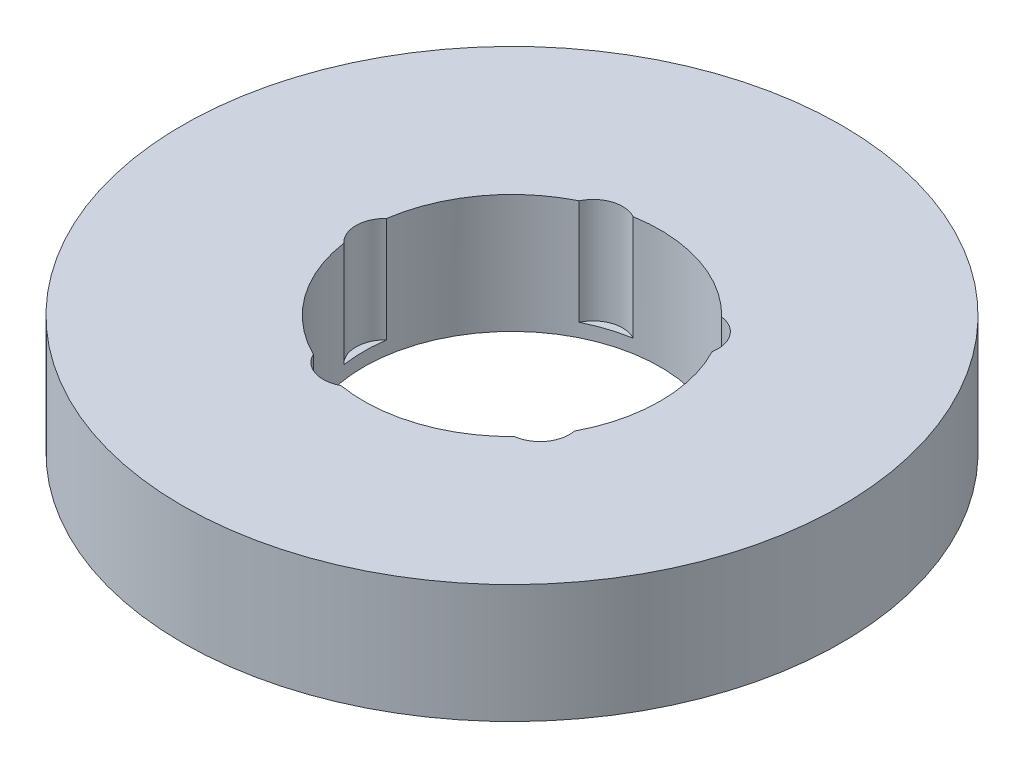
ISO-10303-21;
HEADER;
FILE_DESCRIPTION(('STEP AP214'),'2;1');
FILE_NAME('part.step','',(''),(''),'','','');
FILE_SCHEMA(('AUTOMOTIVE_DESIGN { 1 0 10303 214 1 1 1 1 }'));
ENDSEC;
DATA;
#1=APPLICATION_CONTEXT('core data for automotive mechanical design processes');
#2=APPLICATION_PROTOCOL_DEFINITION('international standard','automotive_design',2000,#1);
#3=PRODUCT_CONTEXT('',#1,'mechanical');
#4=PRODUCT('Part','Part','',(#3));
#5=PRODUCT_RELATED_PRODUCT_CATEGORY('part','',(#4));
#6=PRODUCT_DEFINITION_FORMATION('','',#4);
#7=PRODUCT_DEFINITION_CONTEXT('part definition',#1,'design');
#8=PRODUCT_DEFINITION('design','',#6,#7);
#9=PRODUCT_DEFINITION_SHAPE('','',#8);
#10=(LENGTH_UNIT() NAMED_UNIT(*) SI_UNIT(.MILLI.,.METRE.));
#11=(NAMED_UNIT(*) PLANE_ANGLE_UNIT() SI_UNIT($,.RADIAN.));
#12=(NAMED_UNIT(*) SI_UNIT($,.STERADIAN.) SOLID_ANGLE_UNIT());
#13=UNCERTAINTY_MEASURE_WITH_UNIT(LENGTH_MEASURE(1.E-05),#10,'distance_accuracy_value','');
#14=(GEOMETRIC_REPRESENTATION_CONTEXT(3) GLOBAL_UNCERTAINTY_ASSIGNED_CONTEXT((#13)) GLOBAL_UNIT_ASSIGNED_CONTEXT((#10,
#11,#12)) REPRESENTATION_CONTEXT('',''));
#15=CARTESIAN_POINT('',(0.,0.,0.));
#16=DIRECTION('',(0.,0.,1.));
#17=DIRECTION('',(1.,0.,0.));
#18=AXIS2_PLACEMENT_3D('',#15,#16,#17);
#19=CARTESIAN_POINT('',(0.,18.,0.));
#20=DIRECTION('',(0.,-1.,0.));
#21=DIRECTION('',(0.,0.,-1.));
#22=AXIS2_PLACEMENT_3D('',#19,#20,#21);
#23=CYLINDRICAL_SURFACE('',#22,50.);
#24=CARTESIAN_POINT('',(0.,18.,0.));
#25=DIRECTION('',(0.,1.,0.));
#26=DIRECTION('',(0.,0.,1.));
#27=AXIS2_PLACEMENT_3D('',#24,#25,#26);
#28=CIRCLE('',#27,50.);
#29=CARTESIAN_POINT('',(0.,18.,50.));
#30=VERTEX_POINT('',#29);
#31=EDGE_CURVE('E151',#30,#30,#28,.T.);
#32=ORIENTED_EDGE('',*,*,#31,.F.);
#33=EDGE_LOOP('',(#32));
#34=FACE_BOUND('',#33,.T.);
#35=CARTESIAN_POINT('',(0.,0.,0.));
#36=DIRECTION('',(0.,1.,0.));
#37=DIRECTION('',(0.,0.,1.));
#38=AXIS2_PLACEMENT_3D('',#35,#36,#37);
#39=CIRCLE('',#38,50.);
#40=CARTESIAN_POINT('',(0.,0.,50.));
#41=VERTEX_POINT('',#40);
#42=EDGE_CURVE('E150',#41,#41,#39,.T.);
#43=ORIENTED_EDGE('',*,*,#42,.T.);
#44=EDGE_LOOP('',(#43));
#45=FACE_BOUND('',#44,.T.);
#46=ADVANCED_FACE('F39',(#34,#45),#23,.T.);
#47=CARTESIAN_POINT('',(0.,18.,0.));
#48=DIRECTION('',(0.,1.,0.));
#49=DIRECTION('',(0.,0.,1.));
#50=AXIS2_PLACEMENT_3D('',#47,#48,#49);
#51=PLANE('',#50);
#52=CARTESIAN_POINT('',(-5.92857462690787,18.,-18.2462765281486));
#53=DIRECTION('',(0.,1.,0.));
#54=DIRECTION('',(-0.95105651629515,0.,0.309016994374958));
#55=AXIS2_PLACEMENT_3D('',#52,#53,#54);
#56=CIRCLE('',#55,4.47919357980059);
#57=CARTESIAN_POINT('',(-3.78514938992323,18.,-22.1793292075293));
#58=VERTEX_POINT('',#57);
#59=CARTESIAN_POINT('',(-9.97443243123005,18.,-20.1683092418484));
#60=VERTEX_POINT('',#59);
#61=EDGE_CURVE('E196',#58,#60,#56,.T.);
#62=ORIENTED_EDGE('',*,*,#61,.F.);
#63=CARTESIAN_POINT('',(0.,18.,0.));
#64=DIRECTION('',(0.,1.,0.));
#65=DIRECTION('',(0.,0.,1.));
#66=AXIS2_PLACEMENT_3D('',#63,#64,#65);
#67=CIRCLE('',#66,22.5);
#68=CARTESIAN_POINT('',(16.098932796621,18.,-15.7185992636075));
#69=VERTEX_POINT('',#68);
#70=EDGE_CURVE('E156',#69,#58,#67,.T.);
#71=ORIENTED_EDGE('',*,*,#70,.F.);
#72=CARTESIAN_POINT('',(15.5212098780844,18.,-11.2768190625254));
#73=DIRECTION('',(0.,1.,0.));
#74=DIRECTION('',(-0.58778525229248,0.,-0.809016994374942));
#75=AXIS2_PLACEMENT_3D('',#72,#73,#74);
#76=CIRCLE('',#75,4.47919357980059);
#77=CARTESIAN_POINT('',(19.924120082142,18.,-10.4536806414003));
#78=VERTEX_POINT('',#77);
#79=EDGE_CURVE('E254',#78,#69,#76,.T.);
#80=ORIENTED_EDGE('',*,*,#79,.F.);
#81=CARTESIAN_POINT('',(19.9241200821421,18.,10.4536806414));
#82=VERTEX_POINT('',#81);
#83=EDGE_CURVE('E153',#82,#78,#67,.T.);
#84=ORIENTED_EDGE('',*,*,#83,.F.);
#85=CARTESIAN_POINT('',(15.5212098780846,18.,11.2768190625252));
#86=DIRECTION('',(0.,1.,0.));
#87=DIRECTION('',(0.587785252292469,0.,-0.809016994374951));
#88=AXIS2_PLACEMENT_3D('',#85,#86,#87);
#89=CIRCLE('',#88,4.47919357980059);
#90=CARTESIAN_POINT('',(16.0989327966212,18.,15.7185992636072));
#91=VERTEX_POINT('',#90);
#92=EDGE_CURVE('E248',#91,#82,#89,.T.);
#93=ORIENTED_EDGE('',*,*,#92,.F.);
#94=CARTESIAN_POINT('',(-3.78514938992292,18.,22.1793292075294));
#95=VERTEX_POINT('',#94);
#96=EDGE_CURVE('E140',#95,#91,#67,.T.);
#97=ORIENTED_EDGE('',*,*,#96,.F.);
#98=CARTESIAN_POINT('',(-5.92857462690762,18.,18.2462765281487));
#99=DIRECTION('',(0.,1.,0.));
#100=DIRECTION('',(0.951056516295155,0.,0.309016994374945));
#101=AXIS2_PLACEMENT_3D('',#98,#99,#100);
#102=CIRCLE('',#101,4.47919357980059);
#103=CARTESIAN_POINT('',(-9.97443243122976,18.,20.1683092418485));
#104=VERTEX_POINT('',#103);
#105=EDGE_CURVE('E117',#104,#95,#102,.T.);
#106=ORIENTED_EDGE('',*,*,#105,.F.);
#107=CARTESIAN_POINT('',(-22.2634710576104,18.,3.25389865652634));
#108=VERTEX_POINT('',#107);
#109=EDGE_CURVE('E133',#108,#104,#67,.T.);
#110=ORIENTED_EDGE('',*,*,#109,.F.);
#111=CARTESIAN_POINT('',(-19.1852705023537,18.,0.));
#112=DIRECTION('',(0.,1.,0.));
#113=DIRECTION('',(0.,0.,1.));
#114=AXIS2_PLACEMENT_3D('',#111,#112,#113);
#115=CIRCLE('',#114,4.47919357980059);
#116=CARTESIAN_POINT('',(-22.2634710576104,18.,-3.25389865652634));
#117=VERTEX_POINT('',#116);
#118=EDGE_CURVE('E170',#117,#108,#115,.T.);
#119=ORIENTED_EDGE('',*,*,#118,.F.);
#120=EDGE_CURVE('E149',#60,#117,#67,.T.);
#121=ORIENTED_EDGE('',*,*,#120,.F.);
#122=EDGE_LOOP('',(#62,#71,#80,#84,#93,#97,#106,#110,#119,#121));
#123=FACE_BOUND('',#122,.T.);
#124=ORIENTED_EDGE('',*,*,#31,.T.);
#125=EDGE_LOOP('',(#124));
#126=FACE_BOUND('',#125,.T.);
#127=ADVANCED_FACE('F131',(#123,#126),#51,.T.);
#128=CARTESIAN_POINT('',(0.,0.,0.));
#129=DIRECTION('',(0.,1.,0.));
#130=DIRECTION('',(0.,0.,1.));
#131=AXIS2_PLACEMENT_3D('',#128,#129,#130);
#132=PLANE('',#131);
#133=CARTESIAN_POINT('',(0.,0.,0.));
#134=DIRECTION('',(0.,1.,0.));
#135=DIRECTION('',(0.,0.,1.));
#136=AXIS2_PLACEMENT_3D('',#133,#134,#135);
#137=CIRCLE('',#136,22.5);
#138=CARTESIAN_POINT('',(0.,0.,22.5));
#139=VERTEX_POINT('',#138);
#140=EDGE_CURVE('E160',#139,#139,#137,.T.);
#141=ORIENTED_EDGE('',*,*,#140,.T.);
#142=EDGE_LOOP('',(#141));
#143=FACE_BOUND('',#142,.T.);
#144=ORIENTED_EDGE('',*,*,#42,.F.);
#145=EDGE_LOOP('',(#144));
#146=FACE_BOUND('',#145,.T.);
#147=ADVANCED_FACE('F212',(#143,#146),#132,.F.);
#148=CARTESIAN_POINT('',(0.,18.,0.));
#149=DIRECTION('',(0.,-1.,0.));
#150=DIRECTION('',(0.,0.,-1.));
#151=AXIS2_PLACEMENT_3D('',#148,#149,#150);
#152=CYLINDRICAL_SURFACE('',#151,22.5);
#153=DIRECTION('',(0.,1.,0.));
#154=VECTOR('',#153,1.);
#155=CARTESIAN_POINT('',(-3.78514938992324,10.0191559918322,-22.1793292075293));
#156=LINE('',#155,#154);
#157=CARTESIAN_POINT('',(-3.78514938992323,2.03831198366442,-22.1793292075293));
#158=VERTEX_POINT('',#157);
#159=EDGE_CURVE('E11',#158,#58,#156,.T.);
#160=ORIENTED_EDGE('',*,*,#159,.F.);
#161=CARTESIAN_POINT('',(0.,2.03831198366442,0.));
#162=DIRECTION('',(0.,1.,0.));
#163=DIRECTION('',(0.,0.,1.));
#164=AXIS2_PLACEMENT_3D('',#161,#162,#163);
#165=CIRCLE('',#164,22.5);
#166=CARTESIAN_POINT('',(-9.97443243123005,2.03831198366442,-20.1683092418484));
#167=VERTEX_POINT('',#166);
#168=EDGE_CURVE('E193',#158,#167,#165,.T.);
#169=ORIENTED_EDGE('',*,*,#168,.T.);
#170=DIRECTION('',(0.,1.,0.));
#171=VECTOR('',#170,1.);
#172=CARTESIAN_POINT('',(-9.97443243123005,10.0191559918322,-20.1683092418484));
#173=LINE('',#172,#171);
#174=EDGE_CURVE('E46',#60,#167,#173,.F.);
#175=ORIENTED_EDGE('',*,*,#174,.F.);
#176=ORIENTED_EDGE('',*,*,#120,.T.);
#177=DIRECTION('',(0.,1.,0.));
#178=VECTOR('',#177,1.);
#179=CARTESIAN_POINT('',(-22.2634710576104,10.0191559918322,-3.25389865652633));
#180=LINE('',#179,#178);
#181=CARTESIAN_POINT('',(-22.2634710576104,2.03831198366442,-3.25389865652634));
#182=VERTEX_POINT('',#181);
#183=EDGE_CURVE('E174',#182,#117,#180,.T.);
#184=ORIENTED_EDGE('',*,*,#183,.F.);
#185=CARTESIAN_POINT('',(0.,2.03831198366442,0.));
#186=DIRECTION('',(0.,1.,0.));
#187=DIRECTION('',(0.,0.,1.));
#188=AXIS2_PLACEMENT_3D('',#185,#186,#187);
#189=CIRCLE('',#188,22.5);
#190=CARTESIAN_POINT('',(-22.2634710576104,2.03831198366442,3.25389865652634));
#191=VERTEX_POINT('',#190);
#192=EDGE_CURVE('E171',#182,#191,#189,.T.);
#193=ORIENTED_EDGE('',*,*,#192,.T.);
#194=DIRECTION('',(0.,1.,0.));
#195=VECTOR('',#194,1.);
#196=CARTESIAN_POINT('',(-22.2634710576104,10.0191559918322,3.25389865652633));
#197=LINE('',#196,#195);
#198=EDGE_CURVE('E148',#108,#191,#197,.F.);
#199=ORIENTED_EDGE('',*,*,#198,.F.);
#200=ORIENTED_EDGE('',*,*,#109,.T.);
#201=DIRECTION('',(0.,1.,0.));
#202=VECTOR('',#201,1.);
#203=CARTESIAN_POINT('',(-9.97443243122976,10.0191559918322,20.1683092418485));
#204=LINE('',#203,#202);
#205=CARTESIAN_POINT('',(-9.97443243122976,2.03831198366442,20.1683092418485));
#206=VERTEX_POINT('',#205);
#207=EDGE_CURVE('E111',#206,#104,#204,.T.);
#208=ORIENTED_EDGE('',*,*,#207,.F.);
#209=CARTESIAN_POINT('',(0.,2.03831198366442,0.));
#210=DIRECTION('',(0.,1.,0.));
#211=DIRECTION('',(0.,0.,1.));
#212=AXIS2_PLACEMENT_3D('',#209,#210,#211);
#213=CIRCLE('',#212,22.5);
#214=CARTESIAN_POINT('',(-3.78514938992292,2.03831198366442,22.1793292075294));
#215=VERTEX_POINT('',#214);
#216=EDGE_CURVE('E180',#206,#215,#213,.T.);
#217=ORIENTED_EDGE('',*,*,#216,.T.);
#218=DIRECTION('',(0.,1.,0.));
#219=VECTOR('',#218,1.);
#220=CARTESIAN_POINT('',(-3.78514938992292,10.0191559918322,22.1793292075294));
#221=LINE('',#220,#219);
#222=EDGE_CURVE('E124',#95,#215,#221,.F.);
#223=ORIENTED_EDGE('',*,*,#222,.F.);
#224=ORIENTED_EDGE('',*,*,#96,.T.);
#225=DIRECTION('',(0.,1.,0.));
#226=VECTOR('',#225,1.);
#227=CARTESIAN_POINT('',(16.0989327966212,10.0191559918322,15.7185992636072));
#228=LINE('',#227,#226);
#229=CARTESIAN_POINT('',(16.0989327966212,2.03831198366442,15.7185992636072));
#230=VERTEX_POINT('',#229);
#231=EDGE_CURVE('E183',#230,#91,#228,.T.);
#232=ORIENTED_EDGE('',*,*,#231,.F.);
#233=CARTESIAN_POINT('',(0.,2.03831198366442,0.));
#234=DIRECTION('',(0.,1.,0.));
#235=DIRECTION('',(0.,0.,1.));
#236=AXIS2_PLACEMENT_3D('',#233,#234,#235);
#237=CIRCLE('',#236,22.5);
#238=CARTESIAN_POINT('',(19.9241200821421,2.03831198366442,10.4536806414));
#239=VERTEX_POINT('',#238);
#240=EDGE_CURVE('E123',#230,#239,#237,.T.);
#241=ORIENTED_EDGE('',*,*,#240,.T.);
#242=DIRECTION('',(0.,1.,0.));
#243=VECTOR('',#242,1.);
#244=CARTESIAN_POINT('',(19.9241200821421,10.0191559918322,10.4536806414));
#245=LINE('',#244,#243);
#246=EDGE_CURVE('E185',#82,#239,#245,.F.);
#247=ORIENTED_EDGE('',*,*,#246,.F.);
#248=ORIENTED_EDGE('',*,*,#83,.T.);
#249=DIRECTION('',(0.,1.,0.));
#250=VECTOR('',#249,1.);
#251=CARTESIAN_POINT('',(19.924120082142,10.0191559918322,-10.4536806414003));
#252=LINE('',#251,#250);
#253=CARTESIAN_POINT('',(19.924120082142,2.03831198366442,-10.4536806414003));
#254=VERTEX_POINT('',#253);
#255=EDGE_CURVE('E195',#254,#78,#252,.T.);
#256=ORIENTED_EDGE('',*,*,#255,.F.);
#257=CARTESIAN_POINT('',(0.,2.03831198366442,0.));
#258=DIRECTION('',(0.,1.,0.));
#259=DIRECTION('',(0.,0.,1.));
#260=AXIS2_PLACEMENT_3D('',#257,#258,#259);
#261=CIRCLE('',#260,22.5);
#262=CARTESIAN_POINT('',(16.098932796621,2.03831198366442,-15.7185992636075));
#263=VERTEX_POINT('',#262);
#264=EDGE_CURVE('E190',#254,#263,#261,.T.);
#265=ORIENTED_EDGE('',*,*,#264,.T.);
#266=DIRECTION('',(0.,1.,0.));
#267=VECTOR('',#266,1.);
#268=CARTESIAN_POINT('',(16.098932796621,10.0191559918322,-15.7185992636075));
#269=LINE('',#268,#267);
#270=EDGE_CURVE('E189',#69,#263,#269,.F.);
#271=ORIENTED_EDGE('',*,*,#270,.F.);
#272=ORIENTED_EDGE('',*,*,#70,.T.);
#273=EDGE_LOOP('',(#160,#169,#175,#176,#184,#193,#199,#200,#208,#217,#223,#224,#232,#241,#247,
#248,#256,#265,#271,#272));
#274=FACE_BOUND('',#273,.T.);
#275=ORIENTED_EDGE('',*,*,#140,.F.);
#276=EDGE_LOOP('',(#275));
#277=FACE_BOUND('',#276,.T.);
#278=ADVANCED_FACE('F142',(#274,#277),#152,.F.);
#279=CARTESIAN_POINT('',(-19.1852705023537,2.03831198366442,0.));
#280=DIRECTION('',(0.,1.,0.));
#281=DIRECTION('',(0.,0.,1.));
#282=AXIS2_PLACEMENT_3D('',#279,#280,#281);
#283=CYLINDRICAL_SURFACE('',#282,4.47919357980059);
#284=ORIENTED_EDGE('',*,*,#183,.T.);
#285=ORIENTED_EDGE('',*,*,#118,.T.);
#286=ORIENTED_EDGE('',*,*,#198,.T.);
#287=CARTESIAN_POINT('',(-19.1852705023537,2.03831198366442,0.));
#288=DIRECTION('',(0.,1.,0.));
#289=DIRECTION('',(0.,0.,1.));
#290=AXIS2_PLACEMENT_3D('',#287,#288,#289);
#291=CIRCLE('',#290,4.47919357980059);
#292=EDGE_CURVE('E163',#182,#191,#291,.T.);
#293=ORIENTED_EDGE('',*,*,#292,.F.);
#294=EDGE_LOOP('',(#284,#285,#286,#293));
#295=FACE_BOUND('',#294,.T.);
#296=ADVANCED_FACE('F221',(#295),#283,.F.);
#297=CARTESIAN_POINT('',(-19.1852705023537,2.03831198366442,0.));
#298=DIRECTION('',(0.,1.,0.));
#299=DIRECTION('',(0.,0.,1.));
#300=AXIS2_PLACEMENT_3D('',#297,#298,#299);
#301=PLANE('',#300);
#302=ORIENTED_EDGE('',*,*,#292,.T.);
#303=ORIENTED_EDGE('',*,*,#192,.F.);
#304=EDGE_LOOP('',(#302,#303));
#305=FACE_BOUND('',#304,.T.);
#306=ADVANCED_FACE('F227',(#305),#301,.T.);
#307=CARTESIAN_POINT('',(-5.92857462690762,2.03831198366442,18.2462765281487));
#308=DIRECTION('',(0.,1.,0.));
#309=DIRECTION('',(0.,0.,1.));
#310=AXIS2_PLACEMENT_3D('',#307,#308,#309);
#311=CYLINDRICAL_SURFACE('',#310,4.47919357980059);
#312=ORIENTED_EDGE('',*,*,#207,.T.);
#313=ORIENTED_EDGE('',*,*,#105,.T.);
#314=ORIENTED_EDGE('',*,*,#222,.T.);
#315=CARTESIAN_POINT('',(-5.92857462690762,2.03831198366442,18.2462765281487));
#316=DIRECTION('',(0.,1.,0.));
#317=DIRECTION('',(0.951056516295155,0.,0.309016994374945));
#318=AXIS2_PLACEMENT_3D('',#315,#316,#317);
#319=CIRCLE('',#318,4.47919357980059);
#320=EDGE_CURVE('E119',#206,#215,#319,.T.);
#321=ORIENTED_EDGE('',*,*,#320,.F.);
#322=EDGE_LOOP('',(#312,#313,#314,#321));
#323=FACE_BOUND('',#322,.T.);
#324=ADVANCED_FACE('F116',(#323),#311,.F.);
#325=CARTESIAN_POINT('',(-5.92857462690762,2.03831198366442,18.2462765281487));
#326=DIRECTION('',(0.,1.,0.));
#327=DIRECTION('',(0.951056516295155,0.,0.309016994374945));
#328=AXIS2_PLACEMENT_3D('',#325,#326,#327);
#329=PLANE('',#328);
#330=ORIENTED_EDGE('',*,*,#320,.T.);
#331=ORIENTED_EDGE('',*,*,#216,.F.);
#332=EDGE_LOOP('',(#330,#331));
#333=FACE_BOUND('',#332,.T.);
#334=ADVANCED_FACE('F234',(#333),#329,.T.);
#335=CARTESIAN_POINT('',(15.5212098780846,2.03831198366442,11.2768190625252));
#336=DIRECTION('',(0.,1.,0.));
#337=DIRECTION('',(0.,0.,1.));
#338=AXIS2_PLACEMENT_3D('',#335,#336,#337);
#339=CYLINDRICAL_SURFACE('',#338,4.47919357980059);
#340=ORIENTED_EDGE('',*,*,#231,.T.);
#341=ORIENTED_EDGE('',*,*,#92,.T.);
#342=ORIENTED_EDGE('',*,*,#246,.T.);
#343=CARTESIAN_POINT('',(15.5212098780846,2.03831198366442,11.2768190625252));
#344=DIRECTION('',(0.,1.,0.));
#345=DIRECTION('',(0.587785252292469,0.,-0.809016994374951));
#346=AXIS2_PLACEMENT_3D('',#343,#344,#345);
#347=CIRCLE('',#346,4.47919357980059);
#348=EDGE_CURVE('E137',#230,#239,#347,.T.);
#349=ORIENTED_EDGE('',*,*,#348,.F.);
#350=EDGE_LOOP('',(#340,#341,#342,#349));
#351=FACE_BOUND('',#350,.T.);
#352=ADVANCED_FACE('F240',(#351),#339,.F.);
#353=CARTESIAN_POINT('',(15.5212098780846,2.03831198366442,11.2768190625252));
#354=DIRECTION('',(0.,1.,0.));
#355=DIRECTION('',(0.587785252292469,0.,-0.809016994374951));
#356=AXIS2_PLACEMENT_3D('',#353,#354,#355);
#357=PLANE('',#356);
#358=ORIENTED_EDGE('',*,*,#348,.T.);
#359=ORIENTED_EDGE('',*,*,#240,.F.);
#360=EDGE_LOOP('',(#358,#359));
#361=FACE_BOUND('',#360,.T.);
#362=ADVANCED_FACE('F245',(#361),#357,.T.);
#363=CARTESIAN_POINT('',(15.5212098780844,2.03831198366442,-11.2768190625254));
#364=DIRECTION('',(0.,1.,0.));
#365=DIRECTION('',(0.,0.,1.));
#366=AXIS2_PLACEMENT_3D('',#363,#364,#365);
#367=CYLINDRICAL_SURFACE('',#366,4.47919357980059);
#368=ORIENTED_EDGE('',*,*,#255,.T.);
#369=ORIENTED_EDGE('',*,*,#79,.T.);
#370=ORIENTED_EDGE('',*,*,#270,.T.);
#371=CARTESIAN_POINT('',(15.5212098780844,2.03831198366442,-11.2768190625254));
#372=DIRECTION('',(0.,1.,0.));
#373=DIRECTION('',(-0.58778525229248,0.,-0.809016994374942));
#374=AXIS2_PLACEMENT_3D('',#371,#372,#373);
#375=CIRCLE('',#374,4.47919357980059);
#376=EDGE_CURVE('E56',#254,#263,#375,.T.);
#377=ORIENTED_EDGE('',*,*,#376,.F.);
#378=EDGE_LOOP('',(#368,#369,#370,#377));
#379=FACE_BOUND('',#378,.T.);
#380=ADVANCED_FACE('F264',(#379),#367,.F.);
#381=CARTESIAN_POINT('',(15.5212098780844,2.03831198366442,-11.2768190625254));
#382=DIRECTION('',(0.,1.,0.));
#383=DIRECTION('',(-0.58778525229248,0.,-0.809016994374942));
#384=AXIS2_PLACEMENT_3D('',#381,#382,#383);
#385=PLANE('',#384);
#386=ORIENTED_EDGE('',*,*,#376,.T.);
#387=ORIENTED_EDGE('',*,*,#264,.F.);
#388=EDGE_LOOP('',(#386,#387));
#389=FACE_BOUND('',#388,.T.);
#390=ADVANCED_FACE('F202',(#389),#385,.T.);
#391=CARTESIAN_POINT('',(-5.92857462690787,2.03831198366442,-18.2462765281486));
#392=DIRECTION('',(0.,1.,0.));
#393=DIRECTION('',(0.,0.,1.));
#394=AXIS2_PLACEMENT_3D('',#391,#392,#393);
#395=CYLINDRICAL_SURFACE('',#394,4.47919357980059);
#396=ORIENTED_EDGE('',*,*,#159,.T.);
#397=ORIENTED_EDGE('',*,*,#61,.T.);
#398=ORIENTED_EDGE('',*,*,#174,.T.);
#399=CARTESIAN_POINT('',(-5.92857462690787,2.03831198366442,-18.2462765281486));
#400=DIRECTION('',(0.,1.,0.));
#401=DIRECTION('',(-0.95105651629515,0.,0.309016994374958));
#402=AXIS2_PLACEMENT_3D('',#399,#400,#401);
#403=CIRCLE('',#402,4.47919357980059);
#404=EDGE_CURVE('E55',#158,#167,#403,.T.);
#405=ORIENTED_EDGE('',*,*,#404,.F.);
#406=EDGE_LOOP('',(#396,#397,#398,#405));
#407=FACE_BOUND('',#406,.T.);
#408=ADVANCED_FACE('F197',(#407),#395,.F.);
#409=CARTESIAN_POINT('',(-5.92857462690787,2.03831198366442,-18.2462765281486));
#410=DIRECTION('',(0.,1.,0.));
#411=DIRECTION('',(-0.95105651629515,0.,0.309016994374958));
#412=AXIS2_PLACEMENT_3D('',#409,#410,#411);
#413=PLANE('',#412);
#414=ORIENTED_EDGE('',*,*,#404,.T.);
#415=ORIENTED_EDGE('',*,*,#168,.F.);
#416=EDGE_LOOP('',(#414,#415));
#417=FACE_BOUND('',#416,.T.);
#418=ADVANCED_FACE('F200',(#417),#413,.T.);
#419=CLOSED_SHELL('',(#46,#127,#147,#278,#296,#306,#324,#334,#352,#362,#380,#390,#408,#418));
#420=MANIFOLD_SOLID_BREP('B2',#419);
#421=ADVANCED_BREP_SHAPE_REPRESENTATION('',(#18,#420),#14);
#422=SHAPE_DEFINITION_REPRESENTATION(#9,#421);
ENDSEC;
END-ISO-10303-21;
